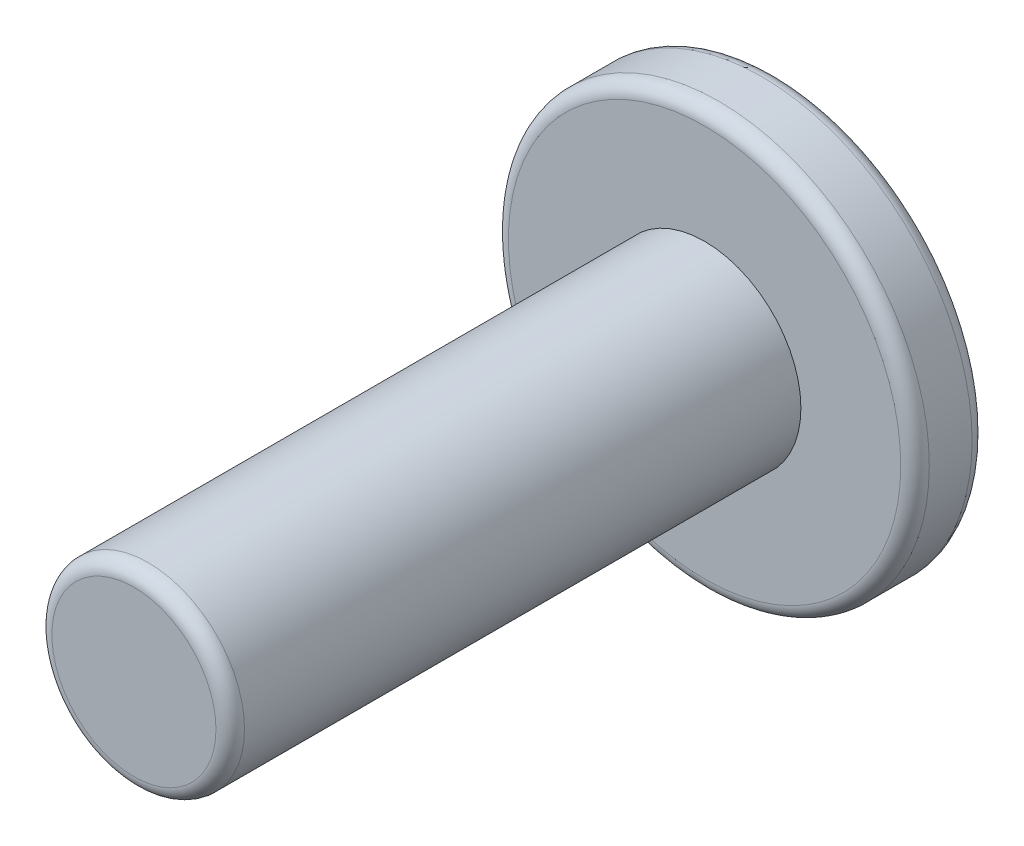
ISO-10303-21;
HEADER;
FILE_DESCRIPTION(('STEP AP214'),'2;1');
FILE_NAME('part.step','',(''),(''),'','','');
FILE_SCHEMA(('AUTOMOTIVE_DESIGN { 1 0 10303 214 1 1 1 1 }'));
ENDSEC;
DATA;
#1=APPLICATION_CONTEXT('core data for automotive mechanical design processes');
#2=APPLICATION_PROTOCOL_DEFINITION('international standard','automotive_design',2000,#1);
#3=PRODUCT_CONTEXT('',#1,'mechanical');
#4=PRODUCT('Part','Part','',(#3));
#5=PRODUCT_RELATED_PRODUCT_CATEGORY('part','',(#4));
#6=PRODUCT_DEFINITION_FORMATION('','',#4);
#7=PRODUCT_DEFINITION_CONTEXT('part definition',#1,'design');
#8=PRODUCT_DEFINITION('design','',#6,#7);
#9=PRODUCT_DEFINITION_SHAPE('','',#8);
#10=(LENGTH_UNIT() NAMED_UNIT(*) SI_UNIT(.MILLI.,.METRE.));
#11=(NAMED_UNIT(*) PLANE_ANGLE_UNIT() SI_UNIT($,.RADIAN.));
#12=(NAMED_UNIT(*) SI_UNIT($,.STERADIAN.) SOLID_ANGLE_UNIT());
#13=UNCERTAINTY_MEASURE_WITH_UNIT(LENGTH_MEASURE(1.E-05),#10,'distance_accuracy_value','');
#14=(GEOMETRIC_REPRESENTATION_CONTEXT(3) GLOBAL_UNCERTAINTY_ASSIGNED_CONTEXT((#13)) GLOBAL_UNIT_ASSIGNED_CONTEXT((#10,
#11,#12)) REPRESENTATION_CONTEXT('',''));
#15=CARTESIAN_POINT('',(0.,0.,0.));
#16=DIRECTION('',(0.,0.,1.));
#17=DIRECTION('',(1.,0.,0.));
#18=AXIS2_PLACEMENT_3D('',#15,#16,#17);
#19=CARTESIAN_POINT('',(0.,0.,1.));
#20=DIRECTION('',(0.,0.,-1.));
#21=DIRECTION('',(-1.,0.,0.));
#22=AXIS2_PLACEMENT_3D('',#19,#20,#21);
#23=CYLINDRICAL_SURFACE('',#22,2.95);
#24=CARTESIAN_POINT('',(0.,0.,0.2));
#25=DIRECTION('',(0.,0.,1.));
#26=DIRECTION('',(1.,0.,0.));
#27=AXIS2_PLACEMENT_3D('',#24,#25,#26);
#28=CIRCLE('',#27,2.95);
#29=CARTESIAN_POINT('',(2.95,0.,0.2));
#30=VERTEX_POINT('',#29);
#31=EDGE_CURVE('E56',#30,#30,#28,.T.);
#32=ORIENTED_EDGE('',*,*,#31,.T.);
#33=EDGE_LOOP('',(#32));
#34=FACE_BOUND('',#33,.T.);
#35=CARTESIAN_POINT('',(0.,0.,0.8));
#36=DIRECTION('',(0.,0.,1.));
#37=DIRECTION('',(1.,0.,0.));
#38=AXIS2_PLACEMENT_3D('',#35,#36,#37);
#39=CIRCLE('',#38,2.95);
#40=CARTESIAN_POINT('',(2.95,0.,0.8));
#41=VERTEX_POINT('',#40);
#42=EDGE_CURVE('E61',#41,#41,#39,.F.);
#43=ORIENTED_EDGE('',*,*,#42,.T.);
#44=EDGE_LOOP('',(#43));
#45=FACE_BOUND('',#44,.T.);
#46=ADVANCED_FACE('F43',(#34,#45),#23,.T.);
#47=CARTESIAN_POINT('',(0.,0.,1.));
#48=DIRECTION('',(0.,0.,1.));
#49=DIRECTION('',(1.,0.,0.));
#50=AXIS2_PLACEMENT_3D('',#47,#48,#49);
#51=PLANE('',#50);
#52=CARTESIAN_POINT('',(0.,0.,1.));
#53=DIRECTION('',(0.,0.,1.));
#54=DIRECTION('',(1.,0.,0.));
#55=AXIS2_PLACEMENT_3D('',#52,#53,#54);
#56=CIRCLE('',#55,2.75);
#57=CARTESIAN_POINT('',(2.75,0.,1.));
#58=VERTEX_POINT('',#57);
#59=EDGE_CURVE('E10',#58,#58,#56,.T.);
#60=ORIENTED_EDGE('',*,*,#59,.T.);
#61=EDGE_LOOP('',(#60));
#62=FACE_BOUND('',#61,.T.);
#63=CARTESIAN_POINT('',(0.,0.,1.));
#64=DIRECTION('',(0.,0.,1.));
#65=DIRECTION('',(1.,0.,0.));
#66=AXIS2_PLACEMENT_3D('',#63,#64,#65);
#67=CIRCLE('',#66,1.35);
#68=CARTESIAN_POINT('',(1.35,0.,1.));
#69=VERTEX_POINT('',#68);
#70=EDGE_CURVE('E75',#69,#69,#67,.T.);
#71=ORIENTED_EDGE('',*,*,#70,.F.);
#72=EDGE_LOOP('',(#71));
#73=FACE_BOUND('',#72,.T.);
#74=ADVANCED_FACE('F82',(#62,#73),#51,.T.);
#75=CARTESIAN_POINT('',(0.,0.,0.));
#76=DIRECTION('',(0.,0.,1.));
#77=DIRECTION('',(1.,0.,0.));
#78=AXIS2_PLACEMENT_3D('',#75,#76,#77);
#79=PLANE('',#78);
#80=CARTESIAN_POINT('',(0.,0.,0.));
#81=DIRECTION('',(0.,0.,1.));
#82=DIRECTION('',(1.,0.,0.));
#83=AXIS2_PLACEMENT_3D('',#80,#81,#82);
#84=CIRCLE('',#83,2.75);
#85=CARTESIAN_POINT('',(2.75,0.,0.));
#86=VERTEX_POINT('',#85);
#87=EDGE_CURVE('E51',#86,#86,#84,.F.);
#88=ORIENTED_EDGE('',*,*,#87,.T.);
#89=EDGE_LOOP('',(#88));
#90=FACE_BOUND('',#89,.T.);
#91=ADVANCED_FACE('F84',(#90),#79,.F.);
#92=CARTESIAN_POINT('',(0.,0.,9.));
#93=DIRECTION('',(0.,0.,-1.));
#94=DIRECTION('',(-1.,0.,0.));
#95=AXIS2_PLACEMENT_3D('',#92,#93,#94);
#96=CYLINDRICAL_SURFACE('',#95,1.35);
#97=CARTESIAN_POINT('',(0.,0.,8.8));
#98=DIRECTION('',(0.,0.,1.));
#99=DIRECTION('',(1.,0.,0.));
#100=AXIS2_PLACEMENT_3D('',#97,#98,#99);
#101=CIRCLE('',#100,1.35);
#102=CARTESIAN_POINT('',(1.35,0.,8.8));
#103=VERTEX_POINT('',#102);
#104=EDGE_CURVE('E67',#103,#103,#101,.F.);
#105=ORIENTED_EDGE('',*,*,#104,.T.);
#106=EDGE_LOOP('',(#105));
#107=FACE_BOUND('',#106,.T.);
#108=ORIENTED_EDGE('',*,*,#70,.T.);
#109=EDGE_LOOP('',(#108));
#110=FACE_BOUND('',#109,.T.);
#111=ADVANCED_FACE('F80',(#107,#110),#96,.T.);
#112=CARTESIAN_POINT('',(0.,0.,9.));
#113=DIRECTION('',(0.,0.,1.));
#114=DIRECTION('',(1.,0.,0.));
#115=AXIS2_PLACEMENT_3D('',#112,#113,#114);
#116=PLANE('',#115);
#117=CARTESIAN_POINT('',(0.,0.,9.));
#118=DIRECTION('',(0.,0.,1.));
#119=DIRECTION('',(1.,0.,0.));
#120=AXIS2_PLACEMENT_3D('',#117,#118,#119);
#121=CIRCLE('',#120,1.15);
#122=CARTESIAN_POINT('',(1.15,0.,9.));
#123=VERTEX_POINT('',#122);
#124=EDGE_CURVE('E71',#123,#123,#121,.T.);
#125=ORIENTED_EDGE('',*,*,#124,.T.);
#126=EDGE_LOOP('',(#125));
#127=FACE_BOUND('',#126,.T.);
#128=ADVANCED_FACE('F99',(#127),#116,.T.);
#129=CARTESIAN_POINT('',(0.,0.,8.8));
#130=DIRECTION('',(0.,0.,1.));
#131=DIRECTION('',(1.,0.,0.));
#132=AXIS2_PLACEMENT_3D('',#129,#130,#131);
#133=TOROIDAL_SURFACE('',#132,1.15,0.2);
#134=ORIENTED_EDGE('',*,*,#104,.F.);
#135=EDGE_LOOP('',(#134));
#136=FACE_BOUND('',#135,.T.);
#137=ORIENTED_EDGE('',*,*,#124,.F.);
#138=EDGE_LOOP('',(#137));
#139=FACE_BOUND('',#138,.T.);
#140=ADVANCED_FACE('F96',(#136,#139),#133,.T.);
#141=CARTESIAN_POINT('',(0.,0.,0.2));
#142=DIRECTION('',(0.,0.,1.));
#143=DIRECTION('',(1.,0.,0.));
#144=AXIS2_PLACEMENT_3D('',#141,#142,#143);
#145=TOROIDAL_SURFACE('',#144,2.75,0.2);
#146=ORIENTED_EDGE('',*,*,#87,.F.);
#147=EDGE_LOOP('',(#146));
#148=FACE_BOUND('',#147,.T.);
#149=ORIENTED_EDGE('',*,*,#31,.F.);
#150=EDGE_LOOP('',(#149));
#151=FACE_BOUND('',#150,.T.);
#152=ADVANCED_FACE('F98',(#148,#151),#145,.T.);
#153=CARTESIAN_POINT('',(0.,0.,0.8));
#154=DIRECTION('',(0.,0.,1.));
#155=DIRECTION('',(1.,0.,0.));
#156=AXIS2_PLACEMENT_3D('',#153,#154,#155);
#157=TOROIDAL_SURFACE('',#156,2.75,0.2);
#158=ORIENTED_EDGE('',*,*,#42,.F.);
#159=EDGE_LOOP('',(#158));
#160=FACE_BOUND('',#159,.T.);
#161=ORIENTED_EDGE('',*,*,#59,.F.);
#162=EDGE_LOOP('',(#161));
#163=FACE_BOUND('',#162,.T.);
#164=ADVANCED_FACE('F45',(#160,#163),#157,.T.);
#165=CLOSED_SHELL('',(#46,#74,#91,#111,#128,#140,#152,#164));
#166=MANIFOLD_SOLID_BREP('B2',#165);
#167=ADVANCED_BREP_SHAPE_REPRESENTATION('',(#18,#166),#14);
#168=SHAPE_DEFINITION_REPRESENTATION(#9,#167);
ENDSEC;
END-ISO-10303-21;
